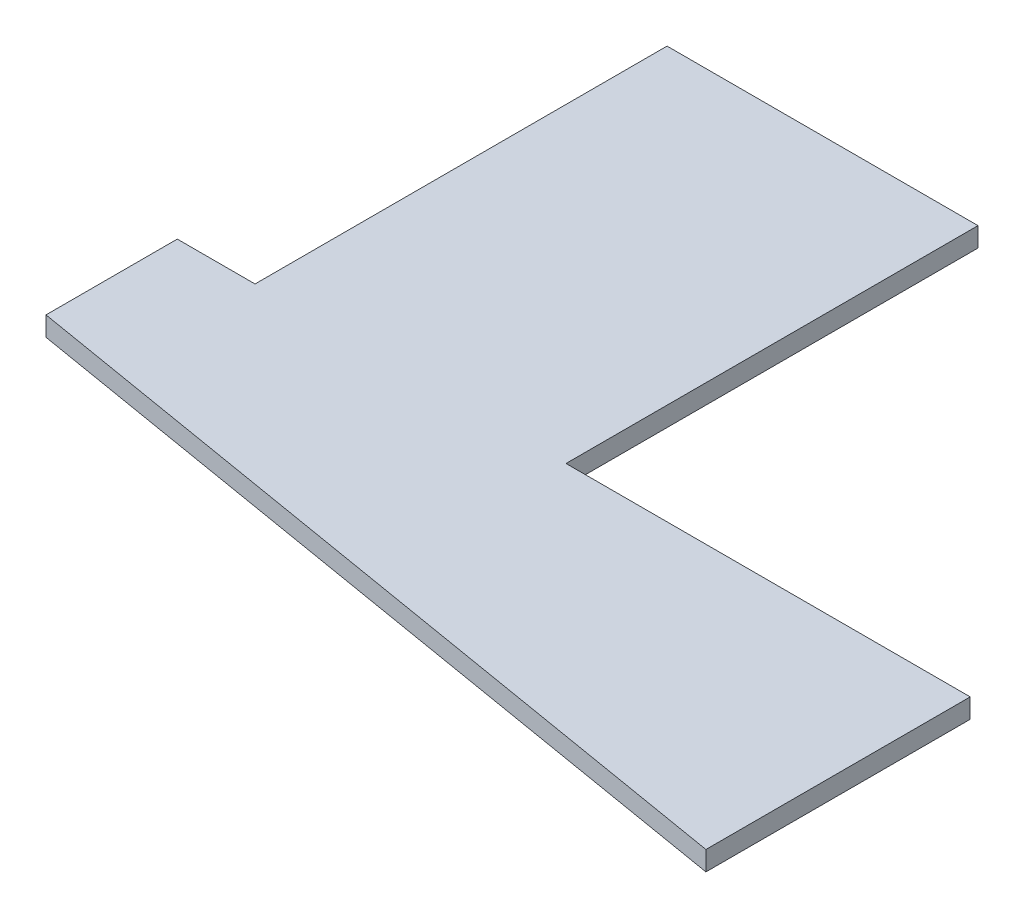
ISO-10303-21;
HEADER;
FILE_DESCRIPTION(('STEP AP214'),'2;1');
FILE_NAME('part.step','',(''),(''),'','','');
FILE_SCHEMA(('AUTOMOTIVE_DESIGN { 1 0 10303 214 1 1 1 1 }'));
ENDSEC;
DATA;
#1=APPLICATION_CONTEXT('core data for automotive mechanical design processes');
#2=APPLICATION_PROTOCOL_DEFINITION('international standard','automotive_design',2000,#1);
#3=PRODUCT_CONTEXT('',#1,'mechanical');
#4=PRODUCT('Part','Part','',(#3));
#5=PRODUCT_RELATED_PRODUCT_CATEGORY('part','',(#4));
#6=PRODUCT_DEFINITION_FORMATION('','',#4);
#7=PRODUCT_DEFINITION_CONTEXT('part definition',#1,'design');
#8=PRODUCT_DEFINITION('design','',#6,#7);
#9=PRODUCT_DEFINITION_SHAPE('','',#8);
#10=(LENGTH_UNIT() NAMED_UNIT(*) SI_UNIT(.MILLI.,.METRE.));
#11=(NAMED_UNIT(*) PLANE_ANGLE_UNIT() SI_UNIT($,.RADIAN.));
#12=(NAMED_UNIT(*) SI_UNIT($,.STERADIAN.) SOLID_ANGLE_UNIT());
#13=UNCERTAINTY_MEASURE_WITH_UNIT(LENGTH_MEASURE(1.E-05),#10,'distance_accuracy_value','');
#14=(GEOMETRIC_REPRESENTATION_CONTEXT(3) GLOBAL_UNCERTAINTY_ASSIGNED_CONTEXT((#13)) GLOBAL_UNIT_ASSIGNED_CONTEXT((#10,
#11,#12)) REPRESENTATION_CONTEXT('',''));
#15=CARTESIAN_POINT('',(0.,0.,0.));
#16=DIRECTION('',(0.,0.,1.));
#17=DIRECTION('',(1.,0.,0.));
#18=AXIS2_PLACEMENT_3D('',#15,#16,#17);
#19=CARTESIAN_POINT('',(-12.7,3.175,0.));
#20=DIRECTION('',(0.,0.,1.));
#21=DIRECTION('',(1.,0.,0.));
#22=AXIS2_PLACEMENT_3D('',#19,#20,#21);
#23=PLANE('',#22);
#24=DIRECTION('',(-1.,0.,0.));
#25=VECTOR('',#24,1.);
#26=CARTESIAN_POINT('',(-12.7,0.,0.));
#27=LINE('',#26,#25);
#28=CARTESIAN_POINT('',(0.,0.,0.));
#29=VERTEX_POINT('',#28);
#30=CARTESIAN_POINT('',(-12.7,0.,0.));
#31=VERTEX_POINT('',#30);
#32=EDGE_CURVE('E145',#29,#31,#27,.T.);
#33=ORIENTED_EDGE('',*,*,#32,.T.);
#34=DIRECTION('',(0.,-1.,0.));
#35=VECTOR('',#34,1.);
#36=CARTESIAN_POINT('',(-12.7,3.175,0.));
#37=LINE('',#36,#35);
#38=CARTESIAN_POINT('',(-12.7,3.175,0.));
#39=VERTEX_POINT('',#38);
#40=EDGE_CURVE('E11',#39,#31,#37,.T.);
#41=ORIENTED_EDGE('',*,*,#40,.F.);
#42=DIRECTION('',(-1.,0.,0.));
#43=VECTOR('',#42,1.);
#44=CARTESIAN_POINT('',(-12.7,3.175,0.));
#45=LINE('',#44,#43);
#46=CARTESIAN_POINT('',(0.,3.175,0.));
#47=VERTEX_POINT('',#46);
#48=EDGE_CURVE('E167',#47,#39,#45,.T.);
#49=ORIENTED_EDGE('',*,*,#48,.F.);
#50=DIRECTION('',(0.,-1.,0.));
#51=VECTOR('',#50,1.);
#52=CARTESIAN_POINT('',(0.,3.175,0.));
#53=LINE('',#52,#51);
#54=EDGE_CURVE('E141',#47,#29,#53,.T.);
#55=ORIENTED_EDGE('',*,*,#54,.T.);
#56=EDGE_LOOP('',(#33,#41,#49,#55));
#57=FACE_BOUND('',#56,.T.);
#58=ADVANCED_FACE('F43',(#57),#23,.F.);
#59=CARTESIAN_POINT('',(-12.7,3.175,21.449244854584));
#60=DIRECTION('',(1.,0.,0.));
#61=DIRECTION('',(0.,0.,-1.));
#62=AXIS2_PLACEMENT_3D('',#59,#60,#61);
#63=PLANE('',#62);
#64=DIRECTION('',(0.,0.,1.));
#65=VECTOR('',#64,1.);
#66=CARTESIAN_POINT('',(-12.7,0.,21.449244854584));
#67=LINE('',#66,#65);
#68=CARTESIAN_POINT('',(-12.7,0.,21.449244854584));
#69=VERTEX_POINT('',#68);
#70=EDGE_CURVE('E149',#31,#69,#67,.T.);
#71=ORIENTED_EDGE('',*,*,#70,.T.);
#72=DIRECTION('',(0.,-1.,0.));
#73=VECTOR('',#72,1.);
#74=CARTESIAN_POINT('',(-12.7,3.175,21.449244854584));
#75=LINE('',#74,#73);
#76=CARTESIAN_POINT('',(-12.7,3.175,21.449244854584));
#77=VERTEX_POINT('',#76);
#78=EDGE_CURVE('E52',#77,#69,#75,.T.);
#79=ORIENTED_EDGE('',*,*,#78,.F.);
#80=DIRECTION('',(0.,0.,1.));
#81=VECTOR('',#80,1.);
#82=CARTESIAN_POINT('',(-12.7,3.175,21.449244854584));
#83=LINE('',#82,#81);
#84=EDGE_CURVE('E103',#39,#77,#83,.T.);
#85=ORIENTED_EDGE('',*,*,#84,.F.);
#86=ORIENTED_EDGE('',*,*,#40,.T.);
#87=EDGE_LOOP('',(#71,#79,#85,#86));
#88=FACE_BOUND('',#87,.T.);
#89=ADVANCED_FACE('F216',(#88),#63,.F.);
#90=CARTESIAN_POINT('',(116.84,3.175,43.18));
#91=DIRECTION('',(0.165441536449811,0.,-0.986219599286653));
#92=DIRECTION('',(-0.986219599286653,0.,-0.165441536449811));
#93=AXIS2_PLACEMENT_3D('',#90,#91,#92);
#94=PLANE('',#93);
#95=DIRECTION('',(0.986219599286653,0.,0.165441536449811));
#96=VECTOR('',#95,1.);
#97=CARTESIAN_POINT('',(116.84,0.,43.18));
#98=LINE('',#97,#96);
#99=CARTESIAN_POINT('',(116.84,0.,43.18));
#100=VERTEX_POINT('',#99);
#101=EDGE_CURVE('E152',#69,#100,#98,.T.);
#102=ORIENTED_EDGE('',*,*,#101,.T.);
#103=DIRECTION('',(0.,-1.,0.));
#104=VECTOR('',#103,1.);
#105=CARTESIAN_POINT('',(116.84,3.175,43.18));
#106=LINE('',#105,#104);
#107=CARTESIAN_POINT('',(116.84,3.175,43.18));
#108=VERTEX_POINT('',#107);
#109=EDGE_CURVE('E178',#108,#100,#106,.T.);
#110=ORIENTED_EDGE('',*,*,#109,.F.);
#111=DIRECTION('',(0.986219599286653,0.,0.165441536449811));
#112=VECTOR('',#111,1.);
#113=CARTESIAN_POINT('',(116.84,3.175,43.18));
#114=LINE('',#113,#112);
#115=EDGE_CURVE('E189',#77,#108,#114,.T.);
#116=ORIENTED_EDGE('',*,*,#115,.F.);
#117=ORIENTED_EDGE('',*,*,#78,.T.);
#118=EDGE_LOOP('',(#102,#110,#116,#117));
#119=FACE_BOUND('',#118,.T.);
#120=ADVANCED_FACE('F187',(#119),#94,.F.);
#121=CARTESIAN_POINT('',(116.84,3.175,43.18));
#122=DIRECTION('',(-1.,0.,0.));
#123=DIRECTION('',(0.,0.,1.));
#124=AXIS2_PLACEMENT_3D('',#121,#122,#123);
#125=PLANE('',#124);
#126=DIRECTION('',(0.,0.,-1.));
#127=VECTOR('',#126,1.);
#128=CARTESIAN_POINT('',(116.84,0.,43.18));
#129=LINE('',#128,#127);
#130=CARTESIAN_POINT('',(116.84,0.,0.));
#131=VERTEX_POINT('',#130);
#132=EDGE_CURVE('E155',#100,#131,#129,.T.);
#133=ORIENTED_EDGE('',*,*,#132,.T.);
#134=DIRECTION('',(0.,-1.,0.));
#135=VECTOR('',#134,1.);
#136=CARTESIAN_POINT('',(116.84,3.175,0.));
#137=LINE('',#136,#135);
#138=CARTESIAN_POINT('',(116.84,3.175,0.));
#139=VERTEX_POINT('',#138);
#140=EDGE_CURVE('E174',#139,#131,#137,.T.);
#141=ORIENTED_EDGE('',*,*,#140,.F.);
#142=DIRECTION('',(0.,0.,-1.));
#143=VECTOR('',#142,1.);
#144=CARTESIAN_POINT('',(116.84,3.175,43.18));
#145=LINE('',#144,#143);
#146=EDGE_CURVE('E202',#108,#139,#145,.T.);
#147=ORIENTED_EDGE('',*,*,#146,.F.);
#148=ORIENTED_EDGE('',*,*,#109,.T.);
#149=EDGE_LOOP('',(#133,#141,#147,#148));
#150=FACE_BOUND('',#149,.T.);
#151=ADVANCED_FACE('F197',(#150),#125,.F.);
#152=CARTESIAN_POINT('',(50.8,3.175,0.));
#153=DIRECTION('',(0.,0.,1.));
#154=DIRECTION('',(1.,0.,0.));
#155=AXIS2_PLACEMENT_3D('',#152,#153,#154);
#156=PLANE('',#155);
#157=DIRECTION('',(-1.,0.,0.));
#158=VECTOR('',#157,1.);
#159=CARTESIAN_POINT('',(50.8,0.,0.));
#160=LINE('',#159,#158);
#161=CARTESIAN_POINT('',(50.8,0.,0.));
#162=VERTEX_POINT('',#161);
#163=EDGE_CURVE('E158',#131,#162,#160,.T.);
#164=ORIENTED_EDGE('',*,*,#163,.T.);
#165=DIRECTION('',(0.,-1.,0.));
#166=VECTOR('',#165,1.);
#167=CARTESIAN_POINT('',(50.8,3.175,0.));
#168=LINE('',#167,#166);
#169=CARTESIAN_POINT('',(50.8,3.175,0.));
#170=VERTEX_POINT('',#169);
#171=EDGE_CURVE('E133',#170,#162,#168,.T.);
#172=ORIENTED_EDGE('',*,*,#171,.F.);
#173=DIRECTION('',(-1.,0.,0.));
#174=VECTOR('',#173,1.);
#175=CARTESIAN_POINT('',(50.8,3.175,0.));
#176=LINE('',#175,#174);
#177=EDGE_CURVE('E122',#139,#170,#176,.T.);
#178=ORIENTED_EDGE('',*,*,#177,.F.);
#179=ORIENTED_EDGE('',*,*,#140,.T.);
#180=EDGE_LOOP('',(#164,#172,#178,#179));
#181=FACE_BOUND('',#180,.T.);
#182=ADVANCED_FACE('F200',(#181),#156,.F.);
#183=CARTESIAN_POINT('',(50.8,3.175,0.));
#184=DIRECTION('',(-1.,0.,0.));
#185=DIRECTION('',(0.,0.,1.));
#186=AXIS2_PLACEMENT_3D('',#183,#184,#185);
#187=PLANE('',#186);
#188=DIRECTION('',(0.,0.,-1.));
#189=VECTOR('',#188,1.);
#190=CARTESIAN_POINT('',(50.8,0.,0.));
#191=LINE('',#190,#189);
#192=CARTESIAN_POINT('',(50.8,0.,-67.31));
#193=VERTEX_POINT('',#192);
#194=EDGE_CURVE('E131',#162,#193,#191,.T.);
#195=ORIENTED_EDGE('',*,*,#194,.T.);
#196=DIRECTION('',(0.,-1.,0.));
#197=VECTOR('',#196,1.);
#198=CARTESIAN_POINT('',(50.8,3.175,-67.31));
#199=LINE('',#198,#197);
#200=CARTESIAN_POINT('',(50.8,3.175,-67.31));
#201=VERTEX_POINT('',#200);
#202=EDGE_CURVE('E128',#201,#193,#199,.T.);
#203=ORIENTED_EDGE('',*,*,#202,.F.);
#204=DIRECTION('',(0.,0.,-1.));
#205=VECTOR('',#204,1.);
#206=CARTESIAN_POINT('',(50.8,3.175,0.));
#207=LINE('',#206,#205);
#208=EDGE_CURVE('E116',#170,#201,#207,.T.);
#209=ORIENTED_EDGE('',*,*,#208,.F.);
#210=ORIENTED_EDGE('',*,*,#171,.T.);
#211=EDGE_LOOP('',(#195,#203,#209,#210));
#212=FACE_BOUND('',#211,.T.);
#213=ADVANCED_FACE('F129',(#212),#187,.F.);
#214=CARTESIAN_POINT('',(0.,3.175,-67.31));
#215=DIRECTION('',(0.,0.,1.));
#216=DIRECTION('',(1.,0.,0.));
#217=AXIS2_PLACEMENT_3D('',#214,#215,#216);
#218=PLANE('',#217);
#219=DIRECTION('',(-1.,0.,0.));
#220=VECTOR('',#219,1.);
#221=CARTESIAN_POINT('',(0.,0.,-67.31));
#222=LINE('',#221,#220);
#223=CARTESIAN_POINT('',(0.,0.,-67.31));
#224=VERTEX_POINT('',#223);
#225=EDGE_CURVE('E89',#193,#224,#222,.T.);
#226=ORIENTED_EDGE('',*,*,#225,.T.);
#227=DIRECTION('',(0.,-1.,0.));
#228=VECTOR('',#227,1.);
#229=CARTESIAN_POINT('',(0.,3.175,-67.31));
#230=LINE('',#229,#228);
#231=CARTESIAN_POINT('',(0.,3.175,-67.31));
#232=VERTEX_POINT('',#231);
#233=EDGE_CURVE('E134',#232,#224,#230,.T.);
#234=ORIENTED_EDGE('',*,*,#233,.F.);
#235=DIRECTION('',(-1.,0.,0.));
#236=VECTOR('',#235,1.);
#237=CARTESIAN_POINT('',(0.,3.175,-67.31));
#238=LINE('',#237,#236);
#239=EDGE_CURVE('E120',#201,#232,#238,.T.);
#240=ORIENTED_EDGE('',*,*,#239,.F.);
#241=ORIENTED_EDGE('',*,*,#202,.T.);
#242=EDGE_LOOP('',(#226,#234,#240,#241));
#243=FACE_BOUND('',#242,.T.);
#244=ADVANCED_FACE('F136',(#243),#218,.F.);
#245=CARTESIAN_POINT('',(0.,3.175,0.));
#246=DIRECTION('',(1.,0.,0.));
#247=DIRECTION('',(0.,0.,-1.));
#248=AXIS2_PLACEMENT_3D('',#245,#246,#247);
#249=PLANE('',#248);
#250=DIRECTION('',(0.,0.,1.));
#251=VECTOR('',#250,1.);
#252=CARTESIAN_POINT('',(0.,0.,0.));
#253=LINE('',#252,#251);
#254=EDGE_CURVE('E95',#224,#29,#253,.T.);
#255=ORIENTED_EDGE('',*,*,#254,.T.);
#256=ORIENTED_EDGE('',*,*,#54,.F.);
#257=DIRECTION('',(0.,0.,1.));
#258=VECTOR('',#257,1.);
#259=CARTESIAN_POINT('',(0.,3.175,0.));
#260=LINE('',#259,#258);
#261=EDGE_CURVE('E60',#232,#47,#260,.T.);
#262=ORIENTED_EDGE('',*,*,#261,.F.);
#263=ORIENTED_EDGE('',*,*,#233,.T.);
#264=EDGE_LOOP('',(#255,#256,#262,#263));
#265=FACE_BOUND('',#264,.T.);
#266=ADVANCED_FACE('F232',(#265),#249,.F.);
#267=CARTESIAN_POINT('',(0.,3.175,0.));
#268=DIRECTION('',(0.,1.,0.));
#269=DIRECTION('',(0.,0.,1.));
#270=AXIS2_PLACEMENT_3D('',#267,#268,#269);
#271=PLANE('',#270);
#272=ORIENTED_EDGE('',*,*,#48,.T.);
#273=ORIENTED_EDGE('',*,*,#84,.T.);
#274=ORIENTED_EDGE('',*,*,#115,.T.);
#275=ORIENTED_EDGE('',*,*,#146,.T.);
#276=ORIENTED_EDGE('',*,*,#177,.T.);
#277=ORIENTED_EDGE('',*,*,#208,.T.);
#278=ORIENTED_EDGE('',*,*,#239,.T.);
#279=ORIENTED_EDGE('',*,*,#261,.T.);
#280=EDGE_LOOP('',(#272,#273,#274,#275,#276,#277,#278,#279));
#281=FACE_BOUND('',#280,.T.);
#282=ADVANCED_FACE('F118',(#281),#271,.T.);
#283=CARTESIAN_POINT('',(0.,0.,0.));
#284=DIRECTION('',(0.,1.,0.));
#285=DIRECTION('',(0.,0.,1.));
#286=AXIS2_PLACEMENT_3D('',#283,#284,#285);
#287=PLANE('',#286);
#288=ORIENTED_EDGE('',*,*,#32,.F.);
#289=ORIENTED_EDGE('',*,*,#254,.F.);
#290=ORIENTED_EDGE('',*,*,#225,.F.);
#291=ORIENTED_EDGE('',*,*,#194,.F.);
#292=ORIENTED_EDGE('',*,*,#163,.F.);
#293=ORIENTED_EDGE('',*,*,#132,.F.);
#294=ORIENTED_EDGE('',*,*,#101,.F.);
#295=ORIENTED_EDGE('',*,*,#70,.F.);
#296=EDGE_LOOP('',(#288,#289,#290,#291,#292,#293,#294,#295));
#297=FACE_BOUND('',#296,.T.);
#298=ADVANCED_FACE('F193',(#297),#287,.F.);
#299=CLOSED_SHELL('',(#58,#89,#120,#151,#182,#213,#244,#266,#282,#298));
#300=MANIFOLD_SOLID_BREP('B2',#299);
#301=ADVANCED_BREP_SHAPE_REPRESENTATION('',(#18,#300),#14);
#302=SHAPE_DEFINITION_REPRESENTATION(#9,#301);
ENDSEC;
END-ISO-10303-21;
